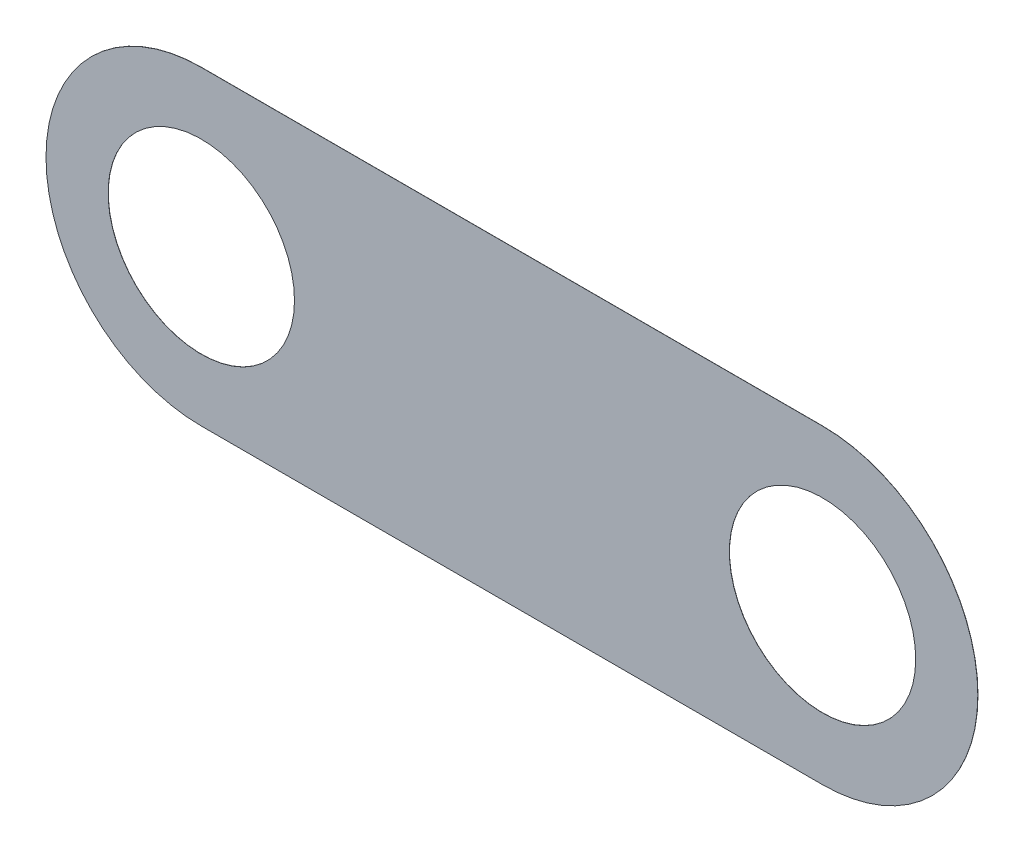
ISO-10303-21;
HEADER;
FILE_DESCRIPTION(('STEP AP214'),'2;1');
FILE_NAME('part.step','',(''),(''),'','','');
FILE_SCHEMA(('AUTOMOTIVE_DESIGN { 1 0 10303 214 1 1 1 1 }'));
ENDSEC;
DATA;
#1=APPLICATION_CONTEXT('core data for automotive mechanical design processes');
#2=APPLICATION_PROTOCOL_DEFINITION('international standard','automotive_design',2000,#1);
#3=PRODUCT_CONTEXT('',#1,'mechanical');
#4=PRODUCT('Part','Part','',(#3));
#5=PRODUCT_RELATED_PRODUCT_CATEGORY('part','',(#4));
#6=PRODUCT_DEFINITION_FORMATION('','',#4);
#7=PRODUCT_DEFINITION_CONTEXT('part definition',#1,'design');
#8=PRODUCT_DEFINITION('design','',#6,#7);
#9=PRODUCT_DEFINITION_SHAPE('','',#8);
#10=(LENGTH_UNIT() NAMED_UNIT(*) SI_UNIT(.MILLI.,.METRE.));
#11=(NAMED_UNIT(*) PLANE_ANGLE_UNIT() SI_UNIT($,.RADIAN.));
#12=(NAMED_UNIT(*) SI_UNIT($,.STERADIAN.) SOLID_ANGLE_UNIT());
#13=UNCERTAINTY_MEASURE_WITH_UNIT(LENGTH_MEASURE(1.E-05),#10,'distance_accuracy_value','');
#14=(GEOMETRIC_REPRESENTATION_CONTEXT(3) GLOBAL_UNCERTAINTY_ASSIGNED_CONTEXT((#13)) GLOBAL_UNIT_ASSIGNED_CONTEXT((#10,
#11,#12)) REPRESENTATION_CONTEXT('',''));
#15=CARTESIAN_POINT('',(0.,0.,0.));
#16=DIRECTION('',(0.,0.,1.));
#17=DIRECTION('',(1.,0.,0.));
#18=AXIS2_PLACEMENT_3D('',#15,#16,#17);
#19=CARTESIAN_POINT('',(0.,0.,0.01));
#20=DIRECTION('',(0.,0.,1.));
#21=DIRECTION('',(1.,0.,0.));
#22=AXIS2_PLACEMENT_3D('',#19,#20,#21);
#23=PLANE('',#22);
#24=CARTESIAN_POINT('',(0.,0.,0.01));
#25=DIRECTION('',(0.,0.,1.));
#26=DIRECTION('',(1.,0.,0.));
#27=AXIS2_PLACEMENT_3D('',#24,#25,#26);
#28=CIRCLE('',#27,6.);
#29=CARTESIAN_POINT('',(6.,0.,0.01));
#30=VERTEX_POINT('',#29);
#31=EDGE_CURVE('E102',#30,#30,#28,.T.);
#32=ORIENTED_EDGE('',*,*,#31,.F.);
#33=EDGE_LOOP('',(#32));
#34=FACE_BOUND('',#33,.T.);
#35=CARTESIAN_POINT('',(0.,0.,0.01));
#36=DIRECTION('',(0.,0.,1.));
#37=DIRECTION('',(1.,0.,0.));
#38=AXIS2_PLACEMENT_3D('',#35,#36,#37);
#39=CIRCLE('',#38,10.);
#40=CARTESIAN_POINT('',(0.,10.,0.01));
#41=VERTEX_POINT('',#40);
#42=CARTESIAN_POINT('',(0.,-10.,0.01));
#43=VERTEX_POINT('',#42);
#44=EDGE_CURVE('E87',#41,#43,#39,.T.);
#45=ORIENTED_EDGE('',*,*,#44,.T.);
#46=DIRECTION('',(1.,0.,0.));
#47=VECTOR('',#46,1.);
#48=CARTESIAN_POINT('',(0.,-10.,0.01));
#49=LINE('',#48,#47);
#50=CARTESIAN_POINT('',(40.,-10.,0.01));
#51=VERTEX_POINT('',#50);
#52=EDGE_CURVE('E82',#43,#51,#49,.T.);
#53=ORIENTED_EDGE('',*,*,#52,.T.);
#54=CARTESIAN_POINT('',(40.,0.,0.01));
#55=DIRECTION('',(0.,0.,1.));
#56=DIRECTION('',(1.,0.,0.));
#57=AXIS2_PLACEMENT_3D('',#54,#55,#56);
#58=CIRCLE('',#57,10.);
#59=CARTESIAN_POINT('',(40.,10.,0.01));
#60=VERTEX_POINT('',#59);
#61=EDGE_CURVE('E85',#51,#60,#58,.T.);
#62=ORIENTED_EDGE('',*,*,#61,.T.);
#63=DIRECTION('',(-1.,0.,0.));
#64=VECTOR('',#63,1.);
#65=CARTESIAN_POINT('',(0.,10.,0.01));
#66=LINE('',#65,#64);
#67=EDGE_CURVE('E52',#60,#41,#66,.T.);
#68=ORIENTED_EDGE('',*,*,#67,.T.);
#69=EDGE_LOOP('',(#45,#53,#62,#68));
#70=FACE_BOUND('',#69,.T.);
#71=CARTESIAN_POINT('',(40.,0.,0.01));
#72=DIRECTION('',(0.,0.,1.));
#73=DIRECTION('',(1.,0.,0.));
#74=AXIS2_PLACEMENT_3D('',#71,#72,#73);
#75=CIRCLE('',#74,5.99999999999999);
#76=CARTESIAN_POINT('',(46.,0.,0.01));
#77=VERTEX_POINT('',#76);
#78=EDGE_CURVE('E117',#77,#77,#75,.T.);
#79=ORIENTED_EDGE('',*,*,#78,.F.);
#80=EDGE_LOOP('',(#79));
#81=FACE_BOUND('',#80,.T.);
#82=ADVANCED_FACE('F35',(#34,#70,#81),#23,.T.);
#83=CARTESIAN_POINT('',(0.,0.,0.));
#84=DIRECTION('',(0.,0.,1.));
#85=DIRECTION('',(1.,0.,0.));
#86=AXIS2_PLACEMENT_3D('',#83,#84,#85);
#87=PLANE('',#86);
#88=CARTESIAN_POINT('',(0.,0.,0.));
#89=DIRECTION('',(0.,0.,1.));
#90=DIRECTION('',(1.,0.,0.));
#91=AXIS2_PLACEMENT_3D('',#88,#89,#90);
#92=CIRCLE('',#91,10.);
#93=CARTESIAN_POINT('',(0.,10.,0.));
#94=VERTEX_POINT('',#93);
#95=CARTESIAN_POINT('',(0.,-10.,0.));
#96=VERTEX_POINT('',#95);
#97=EDGE_CURVE('E99',#94,#96,#92,.T.);
#98=ORIENTED_EDGE('',*,*,#97,.F.);
#99=DIRECTION('',(-1.,0.,0.));
#100=VECTOR('',#99,1.);
#101=CARTESIAN_POINT('',(0.,10.,0.));
#102=LINE('',#101,#100);
#103=CARTESIAN_POINT('',(40.,10.,0.));
#104=VERTEX_POINT('',#103);
#105=EDGE_CURVE('E75',#104,#94,#102,.T.);
#106=ORIENTED_EDGE('',*,*,#105,.F.);
#107=CARTESIAN_POINT('',(40.,0.,0.));
#108=DIRECTION('',(0.,0.,1.));
#109=DIRECTION('',(1.,0.,0.));
#110=AXIS2_PLACEMENT_3D('',#107,#108,#109);
#111=CIRCLE('',#110,10.);
#112=CARTESIAN_POINT('',(40.,-10.,0.));
#113=VERTEX_POINT('',#112);
#114=EDGE_CURVE('E69',#113,#104,#111,.T.);
#115=ORIENTED_EDGE('',*,*,#114,.F.);
#116=DIRECTION('',(1.,0.,0.));
#117=VECTOR('',#116,1.);
#118=CARTESIAN_POINT('',(0.,-10.,0.));
#119=LINE('',#118,#117);
#120=EDGE_CURVE('E91',#96,#113,#119,.T.);
#121=ORIENTED_EDGE('',*,*,#120,.F.);
#122=EDGE_LOOP('',(#98,#106,#115,#121));
#123=FACE_BOUND('',#122,.T.);
#124=CARTESIAN_POINT('',(0.,0.,0.));
#125=DIRECTION('',(0.,0.,1.));
#126=DIRECTION('',(1.,0.,0.));
#127=AXIS2_PLACEMENT_3D('',#124,#125,#126);
#128=CIRCLE('',#127,6.);
#129=CARTESIAN_POINT('',(6.,0.,0.));
#130=VERTEX_POINT('',#129);
#131=EDGE_CURVE('E114',#130,#130,#128,.T.);
#132=ORIENTED_EDGE('',*,*,#131,.T.);
#133=EDGE_LOOP('',(#132));
#134=FACE_BOUND('',#133,.T.);
#135=CARTESIAN_POINT('',(40.,0.,0.));
#136=DIRECTION('',(0.,0.,1.));
#137=DIRECTION('',(1.,0.,0.));
#138=AXIS2_PLACEMENT_3D('',#135,#136,#137);
#139=CIRCLE('',#138,5.99999999999999);
#140=CARTESIAN_POINT('',(46.,0.,0.));
#141=VERTEX_POINT('',#140);
#142=EDGE_CURVE('E120',#141,#141,#139,.T.);
#143=ORIENTED_EDGE('',*,*,#142,.T.);
#144=EDGE_LOOP('',(#143));
#145=FACE_BOUND('',#144,.T.);
#146=ADVANCED_FACE('F110',(#123,#134,#145),#87,.F.);
#147=CARTESIAN_POINT('',(0.,0.,0.01));
#148=DIRECTION('',(0.,0.,-1.));
#149=DIRECTION('',(-1.,0.,0.));
#150=AXIS2_PLACEMENT_3D('',#147,#148,#149);
#151=CYLINDRICAL_SURFACE('',#150,10.);
#152=ORIENTED_EDGE('',*,*,#97,.T.);
#153=DIRECTION('',(0.,0.,-1.));
#154=VECTOR('',#153,1.);
#155=CARTESIAN_POINT('',(0.,-10.,0.01));
#156=LINE('',#155,#154);
#157=EDGE_CURVE('E11',#43,#96,#156,.T.);
#158=ORIENTED_EDGE('',*,*,#157,.F.);
#159=ORIENTED_EDGE('',*,*,#44,.F.);
#160=DIRECTION('',(0.,0.,-1.));
#161=VECTOR('',#160,1.);
#162=CARTESIAN_POINT('',(0.,10.,0.01));
#163=LINE('',#162,#161);
#164=EDGE_CURVE('E95',#41,#94,#163,.T.);
#165=ORIENTED_EDGE('',*,*,#164,.T.);
#166=EDGE_LOOP('',(#152,#158,#159,#165));
#167=FACE_BOUND('',#166,.T.);
#168=ADVANCED_FACE('F37',(#167),#151,.T.);
#169=CARTESIAN_POINT('',(0.,-10.,0.01));
#170=DIRECTION('',(0.,1.,0.));
#171=DIRECTION('',(0.,0.,1.));
#172=AXIS2_PLACEMENT_3D('',#169,#170,#171);
#173=PLANE('',#172);
#174=ORIENTED_EDGE('',*,*,#120,.T.);
#175=DIRECTION('',(0.,0.,-1.));
#176=VECTOR('',#175,1.);
#177=CARTESIAN_POINT('',(40.,-10.,0.01));
#178=LINE('',#177,#176);
#179=EDGE_CURVE('E44',#51,#113,#178,.T.);
#180=ORIENTED_EDGE('',*,*,#179,.F.);
#181=ORIENTED_EDGE('',*,*,#52,.F.);
#182=ORIENTED_EDGE('',*,*,#157,.T.);
#183=EDGE_LOOP('',(#174,#180,#181,#182));
#184=FACE_BOUND('',#183,.T.);
#185=ADVANCED_FACE('F90',(#184),#173,.F.);
#186=CARTESIAN_POINT('',(40.,0.,0.01));
#187=DIRECTION('',(0.,0.,-1.));
#188=DIRECTION('',(-1.,0.,0.));
#189=AXIS2_PLACEMENT_3D('',#186,#187,#188);
#190=CYLINDRICAL_SURFACE('',#189,10.);
#191=ORIENTED_EDGE('',*,*,#114,.T.);
#192=DIRECTION('',(0.,0.,-1.));
#193=VECTOR('',#192,1.);
#194=CARTESIAN_POINT('',(40.,10.,0.01));
#195=LINE('',#194,#193);
#196=EDGE_CURVE('E92',#60,#104,#195,.T.);
#197=ORIENTED_EDGE('',*,*,#196,.F.);
#198=ORIENTED_EDGE('',*,*,#61,.F.);
#199=ORIENTED_EDGE('',*,*,#179,.T.);
#200=EDGE_LOOP('',(#191,#197,#198,#199));
#201=FACE_BOUND('',#200,.T.);
#202=ADVANCED_FACE('F93',(#201),#190,.T.);
#203=CARTESIAN_POINT('',(0.,10.,0.01));
#204=DIRECTION('',(0.,-1.,0.));
#205=DIRECTION('',(0.,0.,-1.));
#206=AXIS2_PLACEMENT_3D('',#203,#204,#205);
#207=PLANE('',#206);
#208=ORIENTED_EDGE('',*,*,#105,.T.);
#209=ORIENTED_EDGE('',*,*,#164,.F.);
#210=ORIENTED_EDGE('',*,*,#67,.F.);
#211=ORIENTED_EDGE('',*,*,#196,.T.);
#212=EDGE_LOOP('',(#208,#209,#210,#211));
#213=FACE_BOUND('',#212,.T.);
#214=ADVANCED_FACE('F107',(#213),#207,.F.);
#215=CARTESIAN_POINT('',(0.,0.,0.01));
#216=DIRECTION('',(0.,0.,-1.));
#217=DIRECTION('',(-1.,0.,0.));
#218=AXIS2_PLACEMENT_3D('',#215,#216,#217);
#219=CYLINDRICAL_SURFACE('',#218,6.);
#220=ORIENTED_EDGE('',*,*,#31,.T.);
#221=EDGE_LOOP('',(#220));
#222=FACE_BOUND('',#221,.T.);
#223=ORIENTED_EDGE('',*,*,#131,.F.);
#224=EDGE_LOOP('',(#223));
#225=FACE_BOUND('',#224,.T.);
#226=ADVANCED_FACE('F137',(#222,#225),#219,.F.);
#227=CARTESIAN_POINT('',(40.,0.,0.01));
#228=DIRECTION('',(0.,0.,-1.));
#229=DIRECTION('',(-1.,0.,0.));
#230=AXIS2_PLACEMENT_3D('',#227,#228,#229);
#231=CYLINDRICAL_SURFACE('',#230,5.99999999999999);
#232=ORIENTED_EDGE('',*,*,#78,.T.);
#233=EDGE_LOOP('',(#232));
#234=FACE_BOUND('',#233,.T.);
#235=ORIENTED_EDGE('',*,*,#142,.F.);
#236=EDGE_LOOP('',(#235));
#237=FACE_BOUND('',#236,.T.);
#238=ADVANCED_FACE('F126',(#234,#237),#231,.F.);
#239=CLOSED_SHELL('',(#82,#146,#168,#185,#202,#214,#226,#238));
#240=MANIFOLD_SOLID_BREP('B2',#239);
#241=ADVANCED_BREP_SHAPE_REPRESENTATION('',(#18,#240),#14);
#242=SHAPE_DEFINITION_REPRESENTATION(#9,#241);
ENDSEC;
END-ISO-10303-21;
